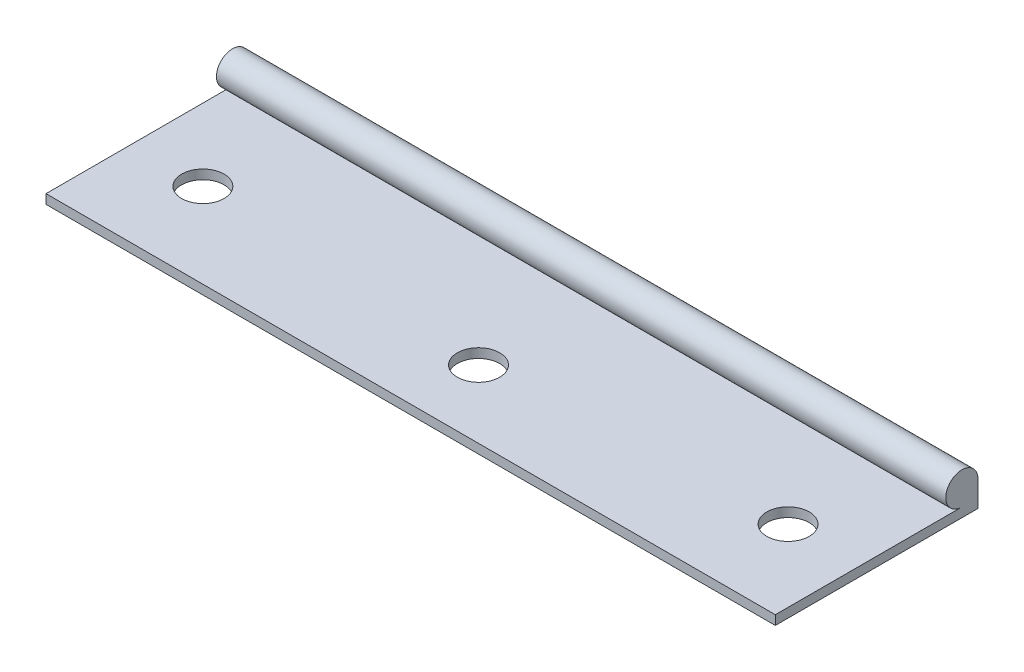
ISO-10303-21;
HEADER;
FILE_DESCRIPTION(('STEP AP214'),'2;1');
FILE_NAME('part.step','',(''),(''),'','','');
FILE_SCHEMA(('AUTOMOTIVE_DESIGN { 1 0 10303 214 1 1 1 1 }'));
ENDSEC;
DATA;
#1=APPLICATION_CONTEXT('core data for automotive mechanical design processes');
#2=APPLICATION_PROTOCOL_DEFINITION('international standard','automotive_design',2000,#1);
#3=PRODUCT_CONTEXT('',#1,'mechanical');
#4=PRODUCT('Part','Part','',(#3));
#5=PRODUCT_RELATED_PRODUCT_CATEGORY('part','',(#4));
#6=PRODUCT_DEFINITION_FORMATION('','',#4);
#7=PRODUCT_DEFINITION_CONTEXT('part definition',#1,'design');
#8=PRODUCT_DEFINITION('design','',#6,#7);
#9=PRODUCT_DEFINITION_SHAPE('','',#8);
#10=(LENGTH_UNIT() NAMED_UNIT(*) SI_UNIT(.MILLI.,.METRE.));
#11=(NAMED_UNIT(*) PLANE_ANGLE_UNIT() SI_UNIT($,.RADIAN.));
#12=(NAMED_UNIT(*) SI_UNIT($,.STERADIAN.) SOLID_ANGLE_UNIT());
#13=UNCERTAINTY_MEASURE_WITH_UNIT(LENGTH_MEASURE(1.E-05),#10,'distance_accuracy_value','');
#14=(GEOMETRIC_REPRESENTATION_CONTEXT(3) GLOBAL_UNCERTAINTY_ASSIGNED_CONTEXT((#13)) GLOBAL_UNIT_ASSIGNED_CONTEXT((#10,
#11,#12)) REPRESENTATION_CONTEXT('',''));
#15=CARTESIAN_POINT('',(0.,0.,0.));
#16=DIRECTION('',(0.,0.,1.));
#17=DIRECTION('',(1.,0.,0.));
#18=AXIS2_PLACEMENT_3D('',#15,#16,#17);
#19=CARTESIAN_POINT('',(86.,3.,-22.));
#20=DIRECTION('',(-1.,0.,0.));
#21=DIRECTION('',(0.,0.,1.));
#22=AXIS2_PLACEMENT_3D('',#19,#20,#21);
#23=CYLINDRICAL_SURFACE('',#22,1.9);
#24=CARTESIAN_POINT('',(0.,3.,-22.));
#25=DIRECTION('',(1.,0.,0.));
#26=DIRECTION('',(0.,0.,-1.));
#27=AXIS2_PLACEMENT_3D('',#24,#25,#26);
#28=CIRCLE('',#27,1.9);
#29=CARTESIAN_POINT('',(0.,3.,-23.9));
#30=VERTEX_POINT('',#29);
#31=CARTESIAN_POINT('',(0.,1.1,-22.));
#32=VERTEX_POINT('',#31);
#33=EDGE_CURVE('E110',#30,#32,#28,.T.);
#34=ORIENTED_EDGE('',*,*,#33,.T.);
#35=DIRECTION('',(-1.,0.,0.));
#36=VECTOR('',#35,1.);
#37=CARTESIAN_POINT('',(86.,1.1,-22.));
#38=LINE('',#37,#36);
#39=CARTESIAN_POINT('',(86.,1.1,-22.));
#40=VERTEX_POINT('',#39);
#41=EDGE_CURVE('E11',#40,#32,#38,.T.);
#42=ORIENTED_EDGE('',*,*,#41,.F.);
#43=CARTESIAN_POINT('',(86.,3.,-22.));
#44=DIRECTION('',(1.,0.,0.));
#45=DIRECTION('',(0.,0.,-1.));
#46=AXIS2_PLACEMENT_3D('',#43,#44,#45);
#47=CIRCLE('',#46,1.9);
#48=CARTESIAN_POINT('',(86.,3.,-23.9));
#49=VERTEX_POINT('',#48);
#50=EDGE_CURVE('E81',#49,#40,#47,.T.);
#51=ORIENTED_EDGE('',*,*,#50,.F.);
#52=DIRECTION('',(-1.,0.,0.));
#53=VECTOR('',#52,1.);
#54=CARTESIAN_POINT('',(86.,3.,-23.9));
#55=LINE('',#54,#53);
#56=EDGE_CURVE('E109',#49,#30,#55,.T.);
#57=ORIENTED_EDGE('',*,*,#56,.T.);
#58=EDGE_LOOP('',(#34,#42,#51,#57));
#59=FACE_BOUND('',#58,.T.);
#60=ADVANCED_FACE('F35',(#59),#23,.T.);
#61=CARTESIAN_POINT('',(86.,1.09999999999999,0.));
#62=DIRECTION('',(0.,1.,0.));
#63=DIRECTION('',(0.,0.,1.));
#64=AXIS2_PLACEMENT_3D('',#61,#62,#63);
#65=PLANE('',#64);
#66=CARTESIAN_POINT('',(77.5,1.09999999999999,-10.));
#67=DIRECTION('',(0.,1.,0.));
#68=DIRECTION('',(0.,0.,1.));
#69=AXIS2_PLACEMENT_3D('',#66,#67,#68);
#70=CIRCLE('',#69,2.5);
#71=CARTESIAN_POINT('',(77.5,1.09999999999999,-7.50000000000001));
#72=VERTEX_POINT('',#71);
#73=EDGE_CURVE('E151',#72,#72,#70,.T.);
#74=ORIENTED_EDGE('',*,*,#73,.F.);
#75=EDGE_LOOP('',(#74));
#76=FACE_BOUND('',#75,.T.);
#77=CARTESIAN_POINT('',(43.,1.09999999999999,-8.));
#78=DIRECTION('',(0.,1.,0.));
#79=DIRECTION('',(0.,0.,1.));
#80=AXIS2_PLACEMENT_3D('',#77,#78,#79);
#81=CIRCLE('',#80,2.5);
#82=CARTESIAN_POINT('',(43.,1.09999999999999,-5.5));
#83=VERTEX_POINT('',#82);
#84=EDGE_CURVE('E155',#83,#83,#81,.T.);
#85=ORIENTED_EDGE('',*,*,#84,.F.);
#86=EDGE_LOOP('',(#85));
#87=FACE_BOUND('',#86,.T.);
#88=CARTESIAN_POINT('',(8.5,1.09999999999999,-10.));
#89=DIRECTION('',(0.,1.,0.));
#90=DIRECTION('',(0.,0.,1.));
#91=AXIS2_PLACEMENT_3D('',#88,#89,#90);
#92=CIRCLE('',#91,2.5);
#93=CARTESIAN_POINT('',(8.5,1.09999999999999,-7.5));
#94=VERTEX_POINT('',#93);
#95=EDGE_CURVE('E158',#94,#94,#92,.T.);
#96=ORIENTED_EDGE('',*,*,#95,.F.);
#97=EDGE_LOOP('',(#96));
#98=FACE_BOUND('',#97,.T.);
#99=DIRECTION('',(0.,0.,-1.));
#100=VECTOR('',#99,1.);
#101=CARTESIAN_POINT('',(0.,1.09999999999999,0.));
#102=LINE('',#101,#100);
#103=CARTESIAN_POINT('',(0.,1.1,0.));
#104=VERTEX_POINT('',#103);
#105=EDGE_CURVE('E113',#104,#32,#102,.T.);
#106=ORIENTED_EDGE('',*,*,#105,.F.);
#107=DIRECTION('',(-1.,0.,0.));
#108=VECTOR('',#107,1.);
#109=CARTESIAN_POINT('',(86.,1.1,0.));
#110=LINE('',#109,#108);
#111=CARTESIAN_POINT('',(86.,1.1,0.));
#112=VERTEX_POINT('',#111);
#113=EDGE_CURVE('E43',#112,#104,#110,.T.);
#114=ORIENTED_EDGE('',*,*,#113,.F.);
#115=DIRECTION('',(0.,0.,-1.));
#116=VECTOR('',#115,1.);
#117=CARTESIAN_POINT('',(86.,1.09999999999999,0.));
#118=LINE('',#117,#116);
#119=EDGE_CURVE('E103',#112,#40,#118,.T.);
#120=ORIENTED_EDGE('',*,*,#119,.T.);
#121=ORIENTED_EDGE('',*,*,#41,.T.);
#122=EDGE_LOOP('',(#106,#114,#120,#121));
#123=FACE_BOUND('',#122,.T.);
#124=ADVANCED_FACE('F123',(#76,#87,#98,#123),#65,.T.);
#125=CARTESIAN_POINT('',(86.,0.,0.));
#126=DIRECTION('',(0.,0.,1.));
#127=DIRECTION('',(1.,0.,0.));
#128=AXIS2_PLACEMENT_3D('',#125,#126,#127);
#129=PLANE('',#128);
#130=DIRECTION('',(0.,1.,0.));
#131=VECTOR('',#130,1.);
#132=CARTESIAN_POINT('',(0.,0.,0.));
#133=LINE('',#132,#131);
#134=CARTESIAN_POINT('',(0.,0.,0.));
#135=VERTEX_POINT('',#134);
#136=EDGE_CURVE('E95',#135,#104,#133,.T.);
#137=ORIENTED_EDGE('',*,*,#136,.F.);
#138=DIRECTION('',(-1.,0.,0.));
#139=VECTOR('',#138,1.);
#140=CARTESIAN_POINT('',(86.,0.,0.));
#141=LINE('',#140,#139);
#142=CARTESIAN_POINT('',(86.,0.,0.));
#143=VERTEX_POINT('',#142);
#144=EDGE_CURVE('E89',#143,#135,#141,.T.);
#145=ORIENTED_EDGE('',*,*,#144,.F.);
#146=DIRECTION('',(0.,1.,0.));
#147=VECTOR('',#146,1.);
#148=CARTESIAN_POINT('',(86.,0.,0.));
#149=LINE('',#148,#147);
#150=EDGE_CURVE('E93',#143,#112,#149,.T.);
#151=ORIENTED_EDGE('',*,*,#150,.T.);
#152=ORIENTED_EDGE('',*,*,#113,.T.);
#153=EDGE_LOOP('',(#137,#145,#151,#152));
#154=FACE_BOUND('',#153,.T.);
#155=ADVANCED_FACE('F91',(#154),#129,.T.);
#156=CARTESIAN_POINT('',(86.,0.,0.));
#157=DIRECTION('',(0.,1.,0.));
#158=DIRECTION('',(0.,0.,1.));
#159=AXIS2_PLACEMENT_3D('',#156,#157,#158);
#160=PLANE('',#159);
#161=CARTESIAN_POINT('',(77.5,0.,-10.));
#162=DIRECTION('',(0.,1.,0.));
#163=DIRECTION('',(0.,0.,1.));
#164=AXIS2_PLACEMENT_3D('',#161,#162,#163);
#165=CIRCLE('',#164,2.5);
#166=CARTESIAN_POINT('',(77.5,0.,-7.50000000000001));
#167=VERTEX_POINT('',#166);
#168=EDGE_CURVE('E160',#167,#167,#165,.T.);
#169=ORIENTED_EDGE('',*,*,#168,.T.);
#170=EDGE_LOOP('',(#169));
#171=FACE_BOUND('',#170,.T.);
#172=CARTESIAN_POINT('',(43.,0.,-8.));
#173=DIRECTION('',(0.,1.,0.));
#174=DIRECTION('',(0.,0.,1.));
#175=AXIS2_PLACEMENT_3D('',#172,#173,#174);
#176=CIRCLE('',#175,2.5);
#177=CARTESIAN_POINT('',(43.,0.,-5.5));
#178=VERTEX_POINT('',#177);
#179=EDGE_CURVE('E168',#178,#178,#176,.T.);
#180=ORIENTED_EDGE('',*,*,#179,.T.);
#181=EDGE_LOOP('',(#180));
#182=FACE_BOUND('',#181,.T.);
#183=CARTESIAN_POINT('',(8.5,0.,-10.));
#184=DIRECTION('',(0.,1.,0.));
#185=DIRECTION('',(0.,0.,1.));
#186=AXIS2_PLACEMENT_3D('',#183,#184,#185);
#187=CIRCLE('',#186,2.5);
#188=CARTESIAN_POINT('',(8.5,0.,-7.5));
#189=VERTEX_POINT('',#188);
#190=EDGE_CURVE('E114',#189,#189,#187,.T.);
#191=ORIENTED_EDGE('',*,*,#190,.T.);
#192=EDGE_LOOP('',(#191));
#193=FACE_BOUND('',#192,.T.);
#194=DIRECTION('',(0.,0.,-1.));
#195=VECTOR('',#194,1.);
#196=CARTESIAN_POINT('',(0.,0.,0.));
#197=LINE('',#196,#195);
#198=CARTESIAN_POINT('',(0.,0.,-23.9));
#199=VERTEX_POINT('',#198);
#200=EDGE_CURVE('E69',#135,#199,#197,.T.);
#201=ORIENTED_EDGE('',*,*,#200,.T.);
#202=DIRECTION('',(-1.,0.,0.));
#203=VECTOR('',#202,1.);
#204=CARTESIAN_POINT('',(86.,0.,-23.9));
#205=LINE('',#204,#203);
#206=CARTESIAN_POINT('',(86.,0.,-23.9));
#207=VERTEX_POINT('',#206);
#208=EDGE_CURVE('E96',#207,#199,#205,.T.);
#209=ORIENTED_EDGE('',*,*,#208,.F.);
#210=DIRECTION('',(0.,0.,-1.));
#211=VECTOR('',#210,1.);
#212=CARTESIAN_POINT('',(86.,0.,0.));
#213=LINE('',#212,#211);
#214=EDGE_CURVE('E98',#143,#207,#213,.T.);
#215=ORIENTED_EDGE('',*,*,#214,.F.);
#216=ORIENTED_EDGE('',*,*,#144,.T.);
#217=EDGE_LOOP('',(#201,#209,#215,#216));
#218=FACE_BOUND('',#217,.T.);
#219=ADVANCED_FACE('F99',(#171,#182,#193,#218),#160,.F.);
#220=CARTESIAN_POINT('',(86.,0.,-23.9));
#221=DIRECTION('',(0.,0.,1.));
#222=DIRECTION('',(1.,0.,0.));
#223=AXIS2_PLACEMENT_3D('',#220,#221,#222);
#224=PLANE('',#223);
#225=DIRECTION('',(0.,1.,0.));
#226=VECTOR('',#225,1.);
#227=CARTESIAN_POINT('',(0.,0.,-23.9));
#228=LINE('',#227,#226);
#229=EDGE_CURVE('E75',#199,#30,#228,.T.);
#230=ORIENTED_EDGE('',*,*,#229,.T.);
#231=ORIENTED_EDGE('',*,*,#56,.F.);
#232=DIRECTION('',(0.,1.,0.));
#233=VECTOR('',#232,1.);
#234=CARTESIAN_POINT('',(86.,0.,-23.9));
#235=LINE('',#234,#233);
#236=EDGE_CURVE('E51',#207,#49,#235,.T.);
#237=ORIENTED_EDGE('',*,*,#236,.F.);
#238=ORIENTED_EDGE('',*,*,#208,.T.);
#239=EDGE_LOOP('',(#230,#231,#237,#238));
#240=FACE_BOUND('',#239,.T.);
#241=ADVANCED_FACE('F128',(#240),#224,.F.);
#242=CARTESIAN_POINT('',(86.,0.,0.));
#243=DIRECTION('',(1.,0.,0.));
#244=DIRECTION('',(0.,0.,-1.));
#245=AXIS2_PLACEMENT_3D('',#242,#243,#244);
#246=PLANE('',#245);
#247=ORIENTED_EDGE('',*,*,#50,.T.);
#248=ORIENTED_EDGE('',*,*,#119,.F.);
#249=ORIENTED_EDGE('',*,*,#150,.F.);
#250=ORIENTED_EDGE('',*,*,#214,.T.);
#251=ORIENTED_EDGE('',*,*,#236,.T.);
#252=EDGE_LOOP('',(#247,#248,#249,#250,#251));
#253=FACE_BOUND('',#252,.T.);
#254=ADVANCED_FACE('F101',(#253),#246,.T.);
#255=CARTESIAN_POINT('',(0.,0.,0.));
#256=DIRECTION('',(1.,0.,0.));
#257=DIRECTION('',(0.,0.,-1.));
#258=AXIS2_PLACEMENT_3D('',#255,#256,#257);
#259=PLANE('',#258);
#260=ORIENTED_EDGE('',*,*,#33,.F.);
#261=ORIENTED_EDGE('',*,*,#229,.F.);
#262=ORIENTED_EDGE('',*,*,#200,.F.);
#263=ORIENTED_EDGE('',*,*,#136,.T.);
#264=ORIENTED_EDGE('',*,*,#105,.T.);
#265=EDGE_LOOP('',(#260,#261,#262,#263,#264));
#266=FACE_BOUND('',#265,.T.);
#267=ADVANCED_FACE('F126',(#266),#259,.F.);
#268=CARTESIAN_POINT('',(8.5,0.,-10.));
#269=DIRECTION('',(0.,1.,0.));
#270=DIRECTION('',(0.,0.,1.));
#271=AXIS2_PLACEMENT_3D('',#268,#269,#270);
#272=CYLINDRICAL_SURFACE('',#271,2.5);
#273=ORIENTED_EDGE('',*,*,#190,.F.);
#274=EDGE_LOOP('',(#273));
#275=FACE_BOUND('',#274,.T.);
#276=ORIENTED_EDGE('',*,*,#95,.T.);
#277=EDGE_LOOP('',(#276));
#278=FACE_BOUND('',#277,.T.);
#279=ADVANCED_FACE('F180',(#275,#278),#272,.F.);
#280=CARTESIAN_POINT('',(43.,0.,-8.));
#281=DIRECTION('',(0.,1.,0.));
#282=DIRECTION('',(0.,0.,1.));
#283=AXIS2_PLACEMENT_3D('',#280,#281,#282);
#284=CYLINDRICAL_SURFACE('',#283,2.5);
#285=ORIENTED_EDGE('',*,*,#179,.F.);
#286=EDGE_LOOP('',(#285));
#287=FACE_BOUND('',#286,.T.);
#288=ORIENTED_EDGE('',*,*,#84,.T.);
#289=EDGE_LOOP('',(#288));
#290=FACE_BOUND('',#289,.T.);
#291=ADVANCED_FACE('F174',(#287,#290),#284,.F.);
#292=CARTESIAN_POINT('',(77.5,0.,-10.));
#293=DIRECTION('',(0.,1.,0.));
#294=DIRECTION('',(0.,0.,1.));
#295=AXIS2_PLACEMENT_3D('',#292,#293,#294);
#296=CYLINDRICAL_SURFACE('',#295,2.5);
#297=ORIENTED_EDGE('',*,*,#168,.F.);
#298=EDGE_LOOP('',(#297));
#299=FACE_BOUND('',#298,.T.);
#300=ORIENTED_EDGE('',*,*,#73,.T.);
#301=EDGE_LOOP('',(#300));
#302=FACE_BOUND('',#301,.T.);
#303=ADVANCED_FACE('F172',(#299,#302),#296,.F.);
#304=CLOSED_SHELL('',(#60,#124,#155,#219,#241,#254,#267,#279,#291,#303));
#305=MANIFOLD_SOLID_BREP('B2',#304);
#306=ADVANCED_BREP_SHAPE_REPRESENTATION('',(#18,#305),#14);
#307=SHAPE_DEFINITION_REPRESENTATION(#9,#306);
ENDSEC;
END-ISO-10303-21;
